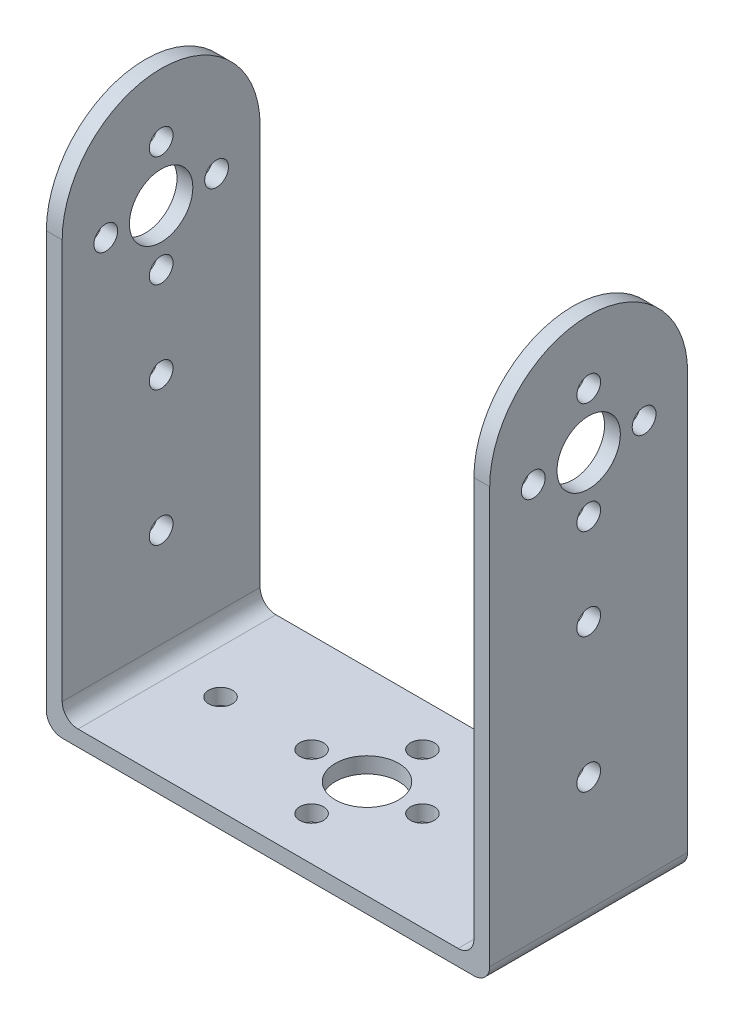
ISO-10303-21;
HEADER;
FILE_DESCRIPTION(('STEP AP214'),'2;1');
FILE_NAME('part.step','',(''),(''),'','','');
FILE_SCHEMA(('AUTOMOTIVE_DESIGN { 1 0 10303 214 1 1 1 1 }'));
ENDSEC;
DATA;
#1=APPLICATION_CONTEXT('core data for automotive mechanical design processes');
#2=APPLICATION_PROTOCOL_DEFINITION('international standard','automotive_design',2000,#1);
#3=PRODUCT_CONTEXT('',#1,'mechanical');
#4=PRODUCT('Part','Part','',(#3));
#5=PRODUCT_RELATED_PRODUCT_CATEGORY('part','',(#4));
#6=PRODUCT_DEFINITION_FORMATION('','',#4);
#7=PRODUCT_DEFINITION_CONTEXT('part definition',#1,'design');
#8=PRODUCT_DEFINITION('design','',#6,#7);
#9=PRODUCT_DEFINITION_SHAPE('','',#8);
#10=(LENGTH_UNIT() NAMED_UNIT(*) SI_UNIT(.MILLI.,.METRE.));
#11=(NAMED_UNIT(*) PLANE_ANGLE_UNIT() SI_UNIT($,.RADIAN.));
#12=(NAMED_UNIT(*) SI_UNIT($,.STERADIAN.) SOLID_ANGLE_UNIT());
#13=UNCERTAINTY_MEASURE_WITH_UNIT(LENGTH_MEASURE(1.E-05),#10,'distance_accuracy_value','');
#14=(GEOMETRIC_REPRESENTATION_CONTEXT(3) GLOBAL_UNCERTAINTY_ASSIGNED_CONTEXT((#13)) GLOBAL_UNIT_ASSIGNED_CONTEXT((#10,
#11,#12)) REPRESENTATION_CONTEXT('',''));
#15=CARTESIAN_POINT('',(0.,0.,0.));
#16=DIRECTION('',(0.,0.,1.));
#17=DIRECTION('',(1.,0.,0.));
#18=AXIS2_PLACEMENT_3D('',#15,#16,#17);
#19=CARTESIAN_POINT('',(28.,-2.,0.));
#20=DIRECTION('',(1.,0.,0.));
#21=DIRECTION('',(0.,0.,-1.));
#22=AXIS2_PLACEMENT_3D('',#19,#20,#21);
#23=PLANE('',#22);
#24=CARTESIAN_POINT('',(28.,50.,6.9999999999999));
#25=DIRECTION('',(1.,0.,0.));
#26=DIRECTION('',(0.,0.,-1.));
#27=AXIS2_PLACEMENT_3D('',#24,#25,#26);
#28=CIRCLE('',#27,1.5);
#29=CARTESIAN_POINT('',(28.,50.,5.4999999999999));
#30=VERTEX_POINT('',#29);
#31=EDGE_CURVE('E490',#30,#30,#28,.T.);
#32=ORIENTED_EDGE('',*,*,#31,.F.);
#33=EDGE_LOOP('',(#32));
#34=FACE_BOUND('',#33,.T.);
#35=CARTESIAN_POINT('',(28.,57.,0.));
#36=DIRECTION('',(1.,0.,0.));
#37=DIRECTION('',(0.,0.,-1.));
#38=AXIS2_PLACEMENT_3D('',#35,#36,#37);
#39=CIRCLE('',#38,1.5);
#40=CARTESIAN_POINT('',(28.,57.,-1.5));
#41=VERTEX_POINT('',#40);
#42=EDGE_CURVE('E487',#41,#41,#39,.T.);
#43=ORIENTED_EDGE('',*,*,#42,.F.);
#44=EDGE_LOOP('',(#43));
#45=FACE_BOUND('',#44,.T.);
#46=CARTESIAN_POINT('',(28.,50.0000000000001,-7.0000000000001));
#47=DIRECTION('',(1.,0.,0.));
#48=DIRECTION('',(0.,0.,-1.));
#49=AXIS2_PLACEMENT_3D('',#46,#47,#48);
#50=CIRCLE('',#49,1.5);
#51=CARTESIAN_POINT('',(28.,50.0000000000001,-8.50000000000009));
#52=VERTEX_POINT('',#51);
#53=EDGE_CURVE('E484',#52,#52,#50,.T.);
#54=ORIENTED_EDGE('',*,*,#53,.F.);
#55=EDGE_LOOP('',(#54));
#56=FACE_BOUND('',#55,.T.);
#57=CARTESIAN_POINT('',(28.,43.,-1.46642216231412E-13));
#58=DIRECTION('',(1.,0.,0.));
#59=DIRECTION('',(0.,0.,-1.));
#60=AXIS2_PLACEMENT_3D('',#57,#58,#59);
#61=CIRCLE('',#60,1.5);
#62=CARTESIAN_POINT('',(28.,43.,-1.50000000000015));
#63=VERTEX_POINT('',#62);
#64=EDGE_CURVE('E483',#63,#63,#61,.T.);
#65=ORIENTED_EDGE('',*,*,#64,.F.);
#66=EDGE_LOOP('',(#65));
#67=FACE_BOUND('',#66,.T.);
#68=CARTESIAN_POINT('',(28.,31.5,0.));
#69=DIRECTION('',(1.,0.,0.));
#70=DIRECTION('',(0.,0.,-1.));
#71=AXIS2_PLACEMENT_3D('',#68,#69,#70);
#72=CIRCLE('',#71,1.5);
#73=CARTESIAN_POINT('',(28.,31.5,-1.5));
#74=VERTEX_POINT('',#73);
#75=EDGE_CURVE('E196',#74,#74,#72,.T.);
#76=ORIENTED_EDGE('',*,*,#75,.F.);
#77=EDGE_LOOP('',(#76));
#78=FACE_BOUND('',#77,.T.);
#79=CARTESIAN_POINT('',(28.,14.5,0.));
#80=DIRECTION('',(1.,0.,0.));
#81=DIRECTION('',(0.,0.,-1.));
#82=AXIS2_PLACEMENT_3D('',#79,#80,#81);
#83=CIRCLE('',#82,1.5);
#84=CARTESIAN_POINT('',(28.,14.5,-1.5));
#85=VERTEX_POINT('',#84);
#86=EDGE_CURVE('E345',#85,#85,#83,.T.);
#87=ORIENTED_EDGE('',*,*,#86,.F.);
#88=EDGE_LOOP('',(#87));
#89=FACE_BOUND('',#88,.T.);
#90=CARTESIAN_POINT('',(28.,50.,0.));
#91=DIRECTION('',(1.,0.,0.));
#92=DIRECTION('',(0.,0.,-1.));
#93=AXIS2_PLACEMENT_3D('',#90,#91,#92);
#94=CIRCLE('',#93,4.);
#95=CARTESIAN_POINT('',(28.,50.,-4.));
#96=VERTEX_POINT('',#95);
#97=EDGE_CURVE('E341',#96,#96,#94,.T.);
#98=ORIENTED_EDGE('',*,*,#97,.F.);
#99=EDGE_LOOP('',(#98));
#100=FACE_BOUND('',#99,.T.);
#101=CARTESIAN_POINT('',(28.,52.5,0.));
#102=DIRECTION('',(1.,0.,0.));
#103=DIRECTION('',(0.,0.,-1.));
#104=AXIS2_PLACEMENT_3D('',#101,#102,#103);
#105=CIRCLE('',#104,12.5);
#106=CARTESIAN_POINT('',(28.,52.5,-12.5));
#107=VERTEX_POINT('',#106);
#108=CARTESIAN_POINT('',(28.,52.5,12.5));
#109=VERTEX_POINT('',#108);
#110=EDGE_CURVE('E178',#107,#109,#105,.T.);
#111=ORIENTED_EDGE('',*,*,#110,.T.);
#112=DIRECTION('',(0.,1.,0.));
#113=VECTOR('',#112,1.);
#114=CARTESIAN_POINT('',(28.,-2.,12.5));
#115=LINE('',#114,#113);
#116=CARTESIAN_POINT('',(28.,0.,12.5));
#117=VERTEX_POINT('',#116);
#118=EDGE_CURVE('E182',#117,#109,#115,.T.);
#119=ORIENTED_EDGE('',*,*,#118,.F.);
#120=DIRECTION('',(0.,0.,-1.));
#121=VECTOR('',#120,1.);
#122=CARTESIAN_POINT('',(28.,0.,-12.5));
#123=LINE('',#122,#121);
#124=CARTESIAN_POINT('',(28.,0.,-12.5));
#125=VERTEX_POINT('',#124);
#126=EDGE_CURVE('E205',#117,#125,#123,.T.);
#127=ORIENTED_EDGE('',*,*,#126,.T.);
#128=DIRECTION('',(0.,1.,0.));
#129=VECTOR('',#128,1.);
#130=CARTESIAN_POINT('',(28.,-2.,-12.5));
#131=LINE('',#130,#129);
#132=EDGE_CURVE('E185',#125,#107,#131,.T.);
#133=ORIENTED_EDGE('',*,*,#132,.T.);
#134=EDGE_LOOP('',(#111,#119,#127,#133));
#135=FACE_BOUND('',#134,.T.);
#136=ADVANCED_FACE('F84',(#34,#45,#56,#67,#78,#89,#100,#135),#23,.T.);
#137=CARTESIAN_POINT('',(-28.,-2.,0.));
#138=DIRECTION('',(1.,0.,0.));
#139=DIRECTION('',(0.,0.,-1.));
#140=AXIS2_PLACEMENT_3D('',#137,#138,#139);
#141=PLANE('',#140);
#142=CARTESIAN_POINT('',(-28.,50.,6.9999999999999));
#143=DIRECTION('',(1.,0.,0.));
#144=DIRECTION('',(0.,0.,-1.));
#145=AXIS2_PLACEMENT_3D('',#142,#143,#144);
#146=CIRCLE('',#145,1.5);
#147=CARTESIAN_POINT('',(-28.,50.,5.4999999999999));
#148=VERTEX_POINT('',#147);
#149=EDGE_CURVE('E189',#148,#148,#146,.T.);
#150=ORIENTED_EDGE('',*,*,#149,.T.);
#151=EDGE_LOOP('',(#150));
#152=FACE_BOUND('',#151,.T.);
#153=CARTESIAN_POINT('',(-28.,57.,0.));
#154=DIRECTION('',(1.,0.,0.));
#155=DIRECTION('',(0.,0.,-1.));
#156=AXIS2_PLACEMENT_3D('',#153,#154,#155);
#157=CIRCLE('',#156,1.5);
#158=CARTESIAN_POINT('',(-28.,57.,-1.5));
#159=VERTEX_POINT('',#158);
#160=EDGE_CURVE('E274',#159,#159,#157,.T.);
#161=ORIENTED_EDGE('',*,*,#160,.T.);
#162=EDGE_LOOP('',(#161));
#163=FACE_BOUND('',#162,.T.);
#164=CARTESIAN_POINT('',(-28.,50.0000000000001,-7.0000000000001));
#165=DIRECTION('',(1.,0.,0.));
#166=DIRECTION('',(0.,0.,-1.));
#167=AXIS2_PLACEMENT_3D('',#164,#165,#166);
#168=CIRCLE('',#167,1.5);
#169=CARTESIAN_POINT('',(-28.,50.0000000000001,-8.50000000000009));
#170=VERTEX_POINT('',#169);
#171=EDGE_CURVE('E270',#170,#170,#168,.T.);
#172=ORIENTED_EDGE('',*,*,#171,.T.);
#173=EDGE_LOOP('',(#172));
#174=FACE_BOUND('',#173,.T.);
#175=CARTESIAN_POINT('',(-28.,43.,-1.46642216231412E-13));
#176=DIRECTION('',(1.,0.,0.));
#177=DIRECTION('',(0.,0.,-1.));
#178=AXIS2_PLACEMENT_3D('',#175,#176,#177);
#179=CIRCLE('',#178,1.5);
#180=CARTESIAN_POINT('',(-28.,43.,-1.50000000000015));
#181=VERTEX_POINT('',#180);
#182=EDGE_CURVE('E266',#181,#181,#179,.T.);
#183=ORIENTED_EDGE('',*,*,#182,.T.);
#184=EDGE_LOOP('',(#183));
#185=FACE_BOUND('',#184,.T.);
#186=CARTESIAN_POINT('',(-28.,50.,0.));
#187=DIRECTION('',(1.,0.,0.));
#188=DIRECTION('',(0.,0.,-1.));
#189=AXIS2_PLACEMENT_3D('',#186,#187,#188);
#190=CIRCLE('',#189,4.);
#191=CARTESIAN_POINT('',(-28.,50.,-4.));
#192=VERTEX_POINT('',#191);
#193=EDGE_CURVE('E252',#192,#192,#190,.T.);
#194=ORIENTED_EDGE('',*,*,#193,.T.);
#195=EDGE_LOOP('',(#194));
#196=FACE_BOUND('',#195,.T.);
#197=CARTESIAN_POINT('',(-28.,14.5,0.));
#198=DIRECTION('',(1.,0.,0.));
#199=DIRECTION('',(0.,0.,-1.));
#200=AXIS2_PLACEMENT_3D('',#197,#198,#199);
#201=CIRCLE('',#200,1.5);
#202=CARTESIAN_POINT('',(-28.,14.5,-1.5));
#203=VERTEX_POINT('',#202);
#204=EDGE_CURVE('E257',#203,#203,#201,.T.);
#205=ORIENTED_EDGE('',*,*,#204,.T.);
#206=EDGE_LOOP('',(#205));
#207=FACE_BOUND('',#206,.T.);
#208=CARTESIAN_POINT('',(-28.,31.5,0.));
#209=DIRECTION('',(1.,0.,0.));
#210=DIRECTION('',(0.,0.,-1.));
#211=AXIS2_PLACEMENT_3D('',#208,#209,#210);
#212=CIRCLE('',#211,1.5);
#213=CARTESIAN_POINT('',(-28.,31.5,-1.5));
#214=VERTEX_POINT('',#213);
#215=EDGE_CURVE('E262',#214,#214,#212,.T.);
#216=ORIENTED_EDGE('',*,*,#215,.T.);
#217=EDGE_LOOP('',(#216));
#218=FACE_BOUND('',#217,.T.);
#219=DIRECTION('',(0.,1.,0.));
#220=VECTOR('',#219,1.);
#221=CARTESIAN_POINT('',(-28.,-2.,12.5));
#222=LINE('',#221,#220);
#223=CARTESIAN_POINT('',(-28.,0.,12.5));
#224=VERTEX_POINT('',#223);
#225=CARTESIAN_POINT('',(-28.,52.5,12.5));
#226=VERTEX_POINT('',#225);
#227=EDGE_CURVE('E203',#224,#226,#222,.T.);
#228=ORIENTED_EDGE('',*,*,#227,.T.);
#229=CARTESIAN_POINT('',(-28.,52.5,0.));
#230=DIRECTION('',(1.,0.,0.));
#231=DIRECTION('',(0.,0.,-1.));
#232=AXIS2_PLACEMENT_3D('',#229,#230,#231);
#233=CIRCLE('',#232,12.5);
#234=CARTESIAN_POINT('',(-28.,52.5,-12.5));
#235=VERTEX_POINT('',#234);
#236=EDGE_CURVE('E296',#235,#226,#233,.T.);
#237=ORIENTED_EDGE('',*,*,#236,.F.);
#238=DIRECTION('',(0.,1.,0.));
#239=VECTOR('',#238,1.);
#240=CARTESIAN_POINT('',(-28.,-2.,-12.5));
#241=LINE('',#240,#239);
#242=CARTESIAN_POINT('',(-28.,0.,-12.5));
#243=VERTEX_POINT('',#242);
#244=EDGE_CURVE('E207',#243,#235,#241,.T.);
#245=ORIENTED_EDGE('',*,*,#244,.F.);
#246=DIRECTION('',(0.,0.,-1.));
#247=VECTOR('',#246,1.);
#248=CARTESIAN_POINT('',(-28.,0.,0.));
#249=LINE('',#248,#247);
#250=EDGE_CURVE('E109',#243,#224,#249,.F.);
#251=ORIENTED_EDGE('',*,*,#250,.T.);
#252=EDGE_LOOP('',(#228,#237,#245,#251));
#253=FACE_BOUND('',#252,.T.);
#254=ADVANCED_FACE('F362',(#152,#163,#174,#185,#196,#207,#218,#253),#141,.F.);
#255=CARTESIAN_POINT('',(-26.,65.,0.));
#256=DIRECTION('',(-1.,0.,0.));
#257=DIRECTION('',(0.,0.,1.));
#258=AXIS2_PLACEMENT_3D('',#255,#256,#257);
#259=PLANE('',#258);
#260=CARTESIAN_POINT('',(-26.,50.,6.9999999999999));
#261=DIRECTION('',(-1.,0.,0.));
#262=DIRECTION('',(0.,0.,1.));
#263=AXIS2_PLACEMENT_3D('',#260,#261,#262);
#264=CIRCLE('',#263,1.5);
#265=CARTESIAN_POINT('',(-26.,50.,8.4999999999999));
#266=VERTEX_POINT('',#265);
#267=EDGE_CURVE('E286',#266,#266,#264,.T.);
#268=ORIENTED_EDGE('',*,*,#267,.T.);
#269=EDGE_LOOP('',(#268));
#270=FACE_BOUND('',#269,.T.);
#271=CARTESIAN_POINT('',(-26.,57.,0.));
#272=DIRECTION('',(-1.,0.,0.));
#273=DIRECTION('',(0.,0.,1.));
#274=AXIS2_PLACEMENT_3D('',#271,#272,#273);
#275=CIRCLE('',#274,1.5);
#276=CARTESIAN_POINT('',(-26.,57.,1.5));
#277=VERTEX_POINT('',#276);
#278=EDGE_CURVE('E269',#277,#277,#275,.T.);
#279=ORIENTED_EDGE('',*,*,#278,.T.);
#280=EDGE_LOOP('',(#279));
#281=FACE_BOUND('',#280,.T.);
#282=CARTESIAN_POINT('',(-26.,50.0000000000001,-7.0000000000001));
#283=DIRECTION('',(-1.,0.,0.));
#284=DIRECTION('',(0.,0.,1.));
#285=AXIS2_PLACEMENT_3D('',#282,#283,#284);
#286=CIRCLE('',#285,1.5);
#287=CARTESIAN_POINT('',(-26.,50.0000000000001,-5.5000000000001));
#288=VERTEX_POINT('',#287);
#289=EDGE_CURVE('E265',#288,#288,#286,.T.);
#290=ORIENTED_EDGE('',*,*,#289,.T.);
#291=EDGE_LOOP('',(#290));
#292=FACE_BOUND('',#291,.T.);
#293=CARTESIAN_POINT('',(-26.,43.,-1.46642216231412E-13));
#294=DIRECTION('',(-1.,0.,0.));
#295=DIRECTION('',(0.,0.,1.));
#296=AXIS2_PLACEMENT_3D('',#293,#294,#295);
#297=CIRCLE('',#296,1.5);
#298=CARTESIAN_POINT('',(-26.,43.,1.49999999999985));
#299=VERTEX_POINT('',#298);
#300=EDGE_CURVE('E261',#299,#299,#297,.T.);
#301=ORIENTED_EDGE('',*,*,#300,.T.);
#302=EDGE_LOOP('',(#301));
#303=FACE_BOUND('',#302,.T.);
#304=CARTESIAN_POINT('',(-26.,50.,0.));
#305=DIRECTION('',(-1.,0.,0.));
#306=DIRECTION('',(0.,0.,1.));
#307=AXIS2_PLACEMENT_3D('',#304,#305,#306);
#308=CIRCLE('',#307,4.);
#309=CARTESIAN_POINT('',(-26.,50.,4.));
#310=VERTEX_POINT('',#309);
#311=EDGE_CURVE('E247',#310,#310,#308,.T.);
#312=ORIENTED_EDGE('',*,*,#311,.T.);
#313=EDGE_LOOP('',(#312));
#314=FACE_BOUND('',#313,.T.);
#315=CARTESIAN_POINT('',(-26.,14.5,0.));
#316=DIRECTION('',(-1.,0.,0.));
#317=DIRECTION('',(0.,0.,1.));
#318=AXIS2_PLACEMENT_3D('',#315,#316,#317);
#319=CIRCLE('',#318,1.5);
#320=CARTESIAN_POINT('',(-26.,14.5,1.5));
#321=VERTEX_POINT('',#320);
#322=EDGE_CURVE('E251',#321,#321,#319,.T.);
#323=ORIENTED_EDGE('',*,*,#322,.T.);
#324=EDGE_LOOP('',(#323));
#325=FACE_BOUND('',#324,.T.);
#326=CARTESIAN_POINT('',(-26.,31.5,0.));
#327=DIRECTION('',(-1.,0.,0.));
#328=DIRECTION('',(0.,0.,1.));
#329=AXIS2_PLACEMENT_3D('',#326,#327,#328);
#330=CIRCLE('',#329,1.5);
#331=CARTESIAN_POINT('',(-26.,31.5,1.5));
#332=VERTEX_POINT('',#331);
#333=EDGE_CURVE('E256',#332,#332,#330,.T.);
#334=ORIENTED_EDGE('',*,*,#333,.T.);
#335=EDGE_LOOP('',(#334));
#336=FACE_BOUND('',#335,.T.);
#337=CARTESIAN_POINT('',(-26.,52.5,0.));
#338=DIRECTION('',(-1.,0.,0.));
#339=DIRECTION('',(0.,0.,1.));
#340=AXIS2_PLACEMENT_3D('',#337,#338,#339);
#341=CIRCLE('',#340,12.5);
#342=CARTESIAN_POINT('',(-26.,52.5,12.5));
#343=VERTEX_POINT('',#342);
#344=CARTESIAN_POINT('',(-26.,52.5,-12.5));
#345=VERTEX_POINT('',#344);
#346=EDGE_CURVE('E294',#343,#345,#341,.T.);
#347=ORIENTED_EDGE('',*,*,#346,.F.);
#348=DIRECTION('',(0.,-1.,0.));
#349=VECTOR('',#348,1.);
#350=CARTESIAN_POINT('',(-26.,65.,12.5));
#351=LINE('',#350,#349);
#352=CARTESIAN_POINT('',(-26.,2.,12.5));
#353=VERTEX_POINT('',#352);
#354=EDGE_CURVE('E303',#343,#353,#351,.T.);
#355=ORIENTED_EDGE('',*,*,#354,.T.);
#356=DIRECTION('',(0.,0.,-1.));
#357=VECTOR('',#356,1.);
#358=CARTESIAN_POINT('',(-26.,2.,0.));
#359=LINE('',#358,#357);
#360=CARTESIAN_POINT('',(-26.,2.,-12.5));
#361=VERTEX_POINT('',#360);
#362=EDGE_CURVE('E235',#353,#361,#359,.T.);
#363=ORIENTED_EDGE('',*,*,#362,.T.);
#364=DIRECTION('',(0.,-1.,0.));
#365=VECTOR('',#364,1.);
#366=CARTESIAN_POINT('',(-26.,65.,-12.5));
#367=LINE('',#366,#365);
#368=EDGE_CURVE('E301',#345,#361,#367,.T.);
#369=ORIENTED_EDGE('',*,*,#368,.F.);
#370=EDGE_LOOP('',(#347,#355,#363,#369));
#371=FACE_BOUND('',#370,.T.);
#372=ADVANCED_FACE('F333',(#270,#281,#292,#303,#314,#325,#336,#371),#259,.F.);
#373=CARTESIAN_POINT('',(26.,65.,0.));
#374=DIRECTION('',(-1.,0.,0.));
#375=DIRECTION('',(0.,0.,1.));
#376=AXIS2_PLACEMENT_3D('',#373,#374,#375);
#377=PLANE('',#376);
#378=CARTESIAN_POINT('',(26.,50.,6.9999999999999));
#379=DIRECTION('',(-1.,0.,0.));
#380=DIRECTION('',(0.,0.,1.));
#381=AXIS2_PLACEMENT_3D('',#378,#379,#380);
#382=CIRCLE('',#381,1.5);
#383=CARTESIAN_POINT('',(26.,50.,8.4999999999999));
#384=VERTEX_POINT('',#383);
#385=EDGE_CURVE('E88',#384,#384,#382,.T.);
#386=ORIENTED_EDGE('',*,*,#385,.F.);
#387=EDGE_LOOP('',(#386));
#388=FACE_BOUND('',#387,.T.);
#389=CARTESIAN_POINT('',(26.,57.,0.));
#390=DIRECTION('',(-1.,0.,0.));
#391=DIRECTION('',(0.,0.,1.));
#392=AXIS2_PLACEMENT_3D('',#389,#390,#391);
#393=CIRCLE('',#392,1.5);
#394=CARTESIAN_POINT('',(26.,57.,1.5));
#395=VERTEX_POINT('',#394);
#396=EDGE_CURVE('E267',#395,#395,#393,.T.);
#397=ORIENTED_EDGE('',*,*,#396,.F.);
#398=EDGE_LOOP('',(#397));
#399=FACE_BOUND('',#398,.T.);
#400=CARTESIAN_POINT('',(26.,50.0000000000001,-7.0000000000001));
#401=DIRECTION('',(-1.,0.,0.));
#402=DIRECTION('',(0.,0.,1.));
#403=AXIS2_PLACEMENT_3D('',#400,#401,#402);
#404=CIRCLE('',#403,1.5);
#405=CARTESIAN_POINT('',(26.,50.0000000000001,-5.5000000000001));
#406=VERTEX_POINT('',#405);
#407=EDGE_CURVE('E263',#406,#406,#404,.T.);
#408=ORIENTED_EDGE('',*,*,#407,.F.);
#409=EDGE_LOOP('',(#408));
#410=FACE_BOUND('',#409,.T.);
#411=CARTESIAN_POINT('',(26.,43.,-1.46642216231412E-13));
#412=DIRECTION('',(-1.,0.,0.));
#413=DIRECTION('',(0.,0.,1.));
#414=AXIS2_PLACEMENT_3D('',#411,#412,#413);
#415=CIRCLE('',#414,1.5);
#416=CARTESIAN_POINT('',(26.,43.,1.49999999999985));
#417=VERTEX_POINT('',#416);
#418=EDGE_CURVE('E258',#417,#417,#415,.T.);
#419=ORIENTED_EDGE('',*,*,#418,.F.);
#420=EDGE_LOOP('',(#419));
#421=FACE_BOUND('',#420,.T.);
#422=CARTESIAN_POINT('',(26.,31.5,0.));
#423=DIRECTION('',(-1.,0.,0.));
#424=DIRECTION('',(0.,0.,1.));
#425=AXIS2_PLACEMENT_3D('',#422,#423,#424);
#426=CIRCLE('',#425,1.5);
#427=CARTESIAN_POINT('',(26.,31.5,1.5));
#428=VERTEX_POINT('',#427);
#429=EDGE_CURVE('E253',#428,#428,#426,.T.);
#430=ORIENTED_EDGE('',*,*,#429,.F.);
#431=EDGE_LOOP('',(#430));
#432=FACE_BOUND('',#431,.T.);
#433=CARTESIAN_POINT('',(26.,14.5,0.));
#434=DIRECTION('',(-1.,0.,0.));
#435=DIRECTION('',(0.,0.,1.));
#436=AXIS2_PLACEMENT_3D('',#433,#434,#435);
#437=CIRCLE('',#436,1.5);
#438=CARTESIAN_POINT('',(26.,14.5,1.5));
#439=VERTEX_POINT('',#438);
#440=EDGE_CURVE('E248',#439,#439,#437,.T.);
#441=ORIENTED_EDGE('',*,*,#440,.F.);
#442=EDGE_LOOP('',(#441));
#443=FACE_BOUND('',#442,.T.);
#444=CARTESIAN_POINT('',(26.,50.,0.));
#445=DIRECTION('',(-1.,0.,0.));
#446=DIRECTION('',(0.,0.,1.));
#447=AXIS2_PLACEMENT_3D('',#444,#445,#446);
#448=CIRCLE('',#447,4.);
#449=CARTESIAN_POINT('',(26.,50.,4.));
#450=VERTEX_POINT('',#449);
#451=EDGE_CURVE('E244',#450,#450,#448,.T.);
#452=ORIENTED_EDGE('',*,*,#451,.F.);
#453=EDGE_LOOP('',(#452));
#454=FACE_BOUND('',#453,.T.);
#455=DIRECTION('',(0.,-1.,0.));
#456=VECTOR('',#455,1.);
#457=CARTESIAN_POINT('',(26.,65.,12.5));
#458=LINE('',#457,#456);
#459=CARTESIAN_POINT('',(26.,52.5,12.5));
#460=VERTEX_POINT('',#459);
#461=CARTESIAN_POINT('',(26.,2.,12.5));
#462=VERTEX_POINT('',#461);
#463=EDGE_CURVE('E101',#460,#462,#458,.T.);
#464=ORIENTED_EDGE('',*,*,#463,.F.);
#465=CARTESIAN_POINT('',(26.,52.5,0.));
#466=DIRECTION('',(-1.,0.,0.));
#467=DIRECTION('',(0.,0.,1.));
#468=AXIS2_PLACEMENT_3D('',#465,#466,#467);
#469=CIRCLE('',#468,12.5);
#470=CARTESIAN_POINT('',(26.,52.5,-12.5));
#471=VERTEX_POINT('',#470);
#472=EDGE_CURVE('E194',#460,#471,#469,.T.);
#473=ORIENTED_EDGE('',*,*,#472,.T.);
#474=DIRECTION('',(0.,-1.,0.));
#475=VECTOR('',#474,1.);
#476=CARTESIAN_POINT('',(26.,65.,-12.5));
#477=LINE('',#476,#475);
#478=CARTESIAN_POINT('',(26.,2.,-12.5));
#479=VERTEX_POINT('',#478);
#480=EDGE_CURVE('E299',#471,#479,#477,.T.);
#481=ORIENTED_EDGE('',*,*,#480,.T.);
#482=DIRECTION('',(0.,0.,-1.));
#483=VECTOR('',#482,1.);
#484=CARTESIAN_POINT('',(26.,2.,12.5));
#485=LINE('',#484,#483);
#486=EDGE_CURVE('E232',#479,#462,#485,.F.);
#487=ORIENTED_EDGE('',*,*,#486,.T.);
#488=EDGE_LOOP('',(#464,#473,#481,#487));
#489=FACE_BOUND('',#488,.T.);
#490=ADVANCED_FACE('F406',(#388,#399,#410,#421,#432,#443,#454,#489),#377,.T.);
#491=CARTESIAN_POINT('',(0.,-2.,-12.5));
#492=DIRECTION('',(0.,0.,1.));
#493=DIRECTION('',(1.,0.,0.));
#494=AXIS2_PLACEMENT_3D('',#491,#492,#493);
#495=PLANE('',#494);
#496=ORIENTED_EDGE('',*,*,#244,.T.);
#497=DIRECTION('',(1.,0.,0.));
#498=VECTOR('',#497,1.);
#499=CARTESIAN_POINT('',(-37.,52.5,-12.5));
#500=LINE('',#499,#498);
#501=EDGE_CURVE('E292',#235,#345,#500,.T.);
#502=ORIENTED_EDGE('',*,*,#501,.T.);
#503=ORIENTED_EDGE('',*,*,#368,.T.);
#504=CARTESIAN_POINT('',(-24.,2.,-12.5));
#505=DIRECTION('',(0.,0.,1.));
#506=DIRECTION('',(1.,0.,0.));
#507=AXIS2_PLACEMENT_3D('',#504,#505,#506);
#508=CIRCLE('',#507,2.);
#509=CARTESIAN_POINT('',(-24.,0.,-12.5));
#510=VERTEX_POINT('',#509);
#511=EDGE_CURVE('E93',#361,#510,#508,.T.);
#512=ORIENTED_EDGE('',*,*,#511,.T.);
#513=DIRECTION('',(1.,0.,0.));
#514=VECTOR('',#513,1.);
#515=CARTESIAN_POINT('',(0.,0.,-12.5));
#516=LINE('',#515,#514);
#517=CARTESIAN_POINT('',(24.,0.,-12.5));
#518=VERTEX_POINT('',#517);
#519=EDGE_CURVE('E305',#510,#518,#516,.T.);
#520=ORIENTED_EDGE('',*,*,#519,.T.);
#521=CARTESIAN_POINT('',(24.,2.,-12.5));
#522=DIRECTION('',(0.,0.,1.));
#523=DIRECTION('',(1.,0.,0.));
#524=AXIS2_PLACEMENT_3D('',#521,#522,#523);
#525=CIRCLE('',#524,2.);
#526=EDGE_CURVE('E238',#518,#479,#525,.T.);
#527=ORIENTED_EDGE('',*,*,#526,.T.);
#528=ORIENTED_EDGE('',*,*,#480,.F.);
#529=EDGE_CURVE('E188',#471,#107,#500,.T.);
#530=ORIENTED_EDGE('',*,*,#529,.T.);
#531=ORIENTED_EDGE('',*,*,#132,.F.);
#532=CARTESIAN_POINT('',(26.,0.,-12.5));
#533=DIRECTION('',(0.,0.,1.));
#534=DIRECTION('',(1.,0.,0.));
#535=AXIS2_PLACEMENT_3D('',#532,#533,#534);
#536=CIRCLE('',#535,2.);
#537=CARTESIAN_POINT('',(26.,-2.,-12.5));
#538=VERTEX_POINT('',#537);
#539=EDGE_CURVE('E217',#125,#538,#536,.F.);
#540=ORIENTED_EDGE('',*,*,#539,.T.);
#541=DIRECTION('',(1.,0.,0.));
#542=VECTOR('',#541,1.);
#543=CARTESIAN_POINT('',(0.,-2.,-12.5));
#544=LINE('',#543,#542);
#545=CARTESIAN_POINT('',(-26.,-2.,-12.5));
#546=VERTEX_POINT('',#545);
#547=EDGE_CURVE('E306',#546,#538,#544,.T.);
#548=ORIENTED_EDGE('',*,*,#547,.F.);
#549=CARTESIAN_POINT('',(-26.,0.,-12.5));
#550=DIRECTION('',(0.,0.,1.));
#551=DIRECTION('',(1.,0.,0.));
#552=AXIS2_PLACEMENT_3D('',#549,#550,#551);
#553=CIRCLE('',#552,2.);
#554=EDGE_CURVE('E215',#546,#243,#553,.F.);
#555=ORIENTED_EDGE('',*,*,#554,.T.);
#556=EDGE_LOOP('',(#496,#502,#503,#512,#520,#527,#528,#530,#531,#540,#548,#555));
#557=FACE_BOUND('',#556,.T.);
#558=ADVANCED_FACE('F326',(#557),#495,.F.);
#559=CARTESIAN_POINT('',(0.,-2.,12.5));
#560=DIRECTION('',(0.,0.,1.));
#561=DIRECTION('',(1.,0.,0.));
#562=AXIS2_PLACEMENT_3D('',#559,#560,#561);
#563=PLANE('',#562);
#564=DIRECTION('',(1.,0.,0.));
#565=VECTOR('',#564,1.);
#566=CARTESIAN_POINT('',(-37.,52.5,12.5));
#567=LINE('',#566,#565);
#568=EDGE_CURVE('E195',#226,#343,#567,.T.);
#569=ORIENTED_EDGE('',*,*,#568,.F.);
#570=ORIENTED_EDGE('',*,*,#227,.F.);
#571=CARTESIAN_POINT('',(-26.,0.,12.5));
#572=DIRECTION('',(0.,0.,1.));
#573=DIRECTION('',(1.,0.,0.));
#574=AXIS2_PLACEMENT_3D('',#571,#572,#573);
#575=CIRCLE('',#574,2.);
#576=CARTESIAN_POINT('',(-26.,-2.,12.5));
#577=VERTEX_POINT('',#576);
#578=EDGE_CURVE('E224',#224,#577,#575,.T.);
#579=ORIENTED_EDGE('',*,*,#578,.T.);
#580=DIRECTION('',(1.,0.,0.));
#581=VECTOR('',#580,1.);
#582=CARTESIAN_POINT('',(0.,-2.,12.5));
#583=LINE('',#582,#581);
#584=CARTESIAN_POINT('',(26.,-2.,12.5));
#585=VERTEX_POINT('',#584);
#586=EDGE_CURVE('E213',#577,#585,#583,.T.);
#587=ORIENTED_EDGE('',*,*,#586,.T.);
#588=CARTESIAN_POINT('',(26.,0.,12.5));
#589=DIRECTION('',(0.,0.,1.));
#590=DIRECTION('',(1.,0.,0.));
#591=AXIS2_PLACEMENT_3D('',#588,#589,#590);
#592=CIRCLE('',#591,2.);
#593=EDGE_CURVE('E202',#585,#117,#592,.T.);
#594=ORIENTED_EDGE('',*,*,#593,.T.);
#595=ORIENTED_EDGE('',*,*,#118,.T.);
#596=EDGE_CURVE('E191',#460,#109,#567,.T.);
#597=ORIENTED_EDGE('',*,*,#596,.F.);
#598=ORIENTED_EDGE('',*,*,#463,.T.);
#599=CARTESIAN_POINT('',(24.,2.,12.5));
#600=DIRECTION('',(0.,0.,1.));
#601=DIRECTION('',(1.,0.,0.));
#602=AXIS2_PLACEMENT_3D('',#599,#600,#601);
#603=CIRCLE('',#602,2.);
#604=CARTESIAN_POINT('',(24.,0.,12.5));
#605=VERTEX_POINT('',#604);
#606=EDGE_CURVE('E241',#462,#605,#603,.F.);
#607=ORIENTED_EDGE('',*,*,#606,.T.);
#608=DIRECTION('',(1.,0.,0.));
#609=VECTOR('',#608,1.);
#610=CARTESIAN_POINT('',(0.,0.,12.5));
#611=LINE('',#610,#609);
#612=CARTESIAN_POINT('',(-24.,0.,12.5));
#613=VERTEX_POINT('',#612);
#614=EDGE_CURVE('E309',#613,#605,#611,.T.);
#615=ORIENTED_EDGE('',*,*,#614,.F.);
#616=CARTESIAN_POINT('',(-24.,2.,12.5));
#617=DIRECTION('',(0.,0.,1.));
#618=DIRECTION('',(1.,0.,0.));
#619=AXIS2_PLACEMENT_3D('',#616,#617,#618);
#620=CIRCLE('',#619,2.);
#621=EDGE_CURVE('E12',#613,#353,#620,.F.);
#622=ORIENTED_EDGE('',*,*,#621,.T.);
#623=ORIENTED_EDGE('',*,*,#354,.F.);
#624=EDGE_LOOP('',(#569,#570,#579,#587,#594,#595,#597,#598,#607,#615,#622,#623));
#625=FACE_BOUND('',#624,.T.);
#626=ADVANCED_FACE('F199',(#625),#563,.T.);
#627=CARTESIAN_POINT('',(0.,-2.,0.));
#628=DIRECTION('',(0.,1.,0.));
#629=DIRECTION('',(0.,0.,1.));
#630=AXIS2_PLACEMENT_3D('',#627,#628,#629);
#631=PLANE('',#630);
#632=CARTESIAN_POINT('',(0.,-2.,-7.));
#633=DIRECTION('',(0.,1.,0.));
#634=DIRECTION('',(0.,0.,1.));
#635=AXIS2_PLACEMENT_3D('',#632,#633,#634);
#636=CIRCLE('',#635,1.5);
#637=CARTESIAN_POINT('',(0.,-2.,-5.5));
#638=VERTEX_POINT('',#637);
#639=EDGE_CURVE('E445',#638,#638,#636,.T.);
#640=ORIENTED_EDGE('',*,*,#639,.T.);
#641=EDGE_LOOP('',(#640));
#642=FACE_BOUND('',#641,.T.);
#643=CARTESIAN_POINT('',(-18.5,-2.,0.));
#644=DIRECTION('',(0.,1.,0.));
#645=DIRECTION('',(0.,0.,1.));
#646=AXIS2_PLACEMENT_3D('',#643,#644,#645);
#647=CIRCLE('',#646,1.5);
#648=CARTESIAN_POINT('',(-18.5,-2.,1.5));
#649=VERTEX_POINT('',#648);
#650=EDGE_CURVE('E449',#649,#649,#647,.T.);
#651=ORIENTED_EDGE('',*,*,#650,.T.);
#652=EDGE_LOOP('',(#651));
#653=FACE_BOUND('',#652,.T.);
#654=CARTESIAN_POINT('',(18.5,-2.,0.));
#655=DIRECTION('',(0.,1.,0.));
#656=DIRECTION('',(0.,0.,1.));
#657=AXIS2_PLACEMENT_3D('',#654,#655,#656);
#658=CIRCLE('',#657,1.5);
#659=CARTESIAN_POINT('',(18.5,-2.,1.5));
#660=VERTEX_POINT('',#659);
#661=EDGE_CURVE('E453',#660,#660,#658,.T.);
#662=ORIENTED_EDGE('',*,*,#661,.T.);
#663=EDGE_LOOP('',(#662));
#664=FACE_BOUND('',#663,.T.);
#665=CARTESIAN_POINT('',(7.0000000000002,-2.,-1.97666086873723E-13));
#666=DIRECTION('',(0.,1.,0.));
#667=DIRECTION('',(0.,0.,1.));
#668=AXIS2_PLACEMENT_3D('',#665,#666,#667);
#669=CIRCLE('',#668,1.50000000000015);
#670=CARTESIAN_POINT('',(7.0000000000002,-2.,1.49999999999996));
#671=VERTEX_POINT('',#670);
#672=EDGE_CURVE('E457',#671,#671,#669,.T.);
#673=ORIENTED_EDGE('',*,*,#672,.T.);
#674=EDGE_LOOP('',(#673));
#675=FACE_BOUND('',#674,.T.);
#676=CARTESIAN_POINT('',(2.00586374889466E-13,-2.,6.9999999999998));
#677=DIRECTION('',(0.,1.,0.));
#678=DIRECTION('',(0.,0.,1.));
#679=AXIS2_PLACEMENT_3D('',#676,#677,#678);
#680=CIRCLE('',#679,1.5000000000003);
#681=CARTESIAN_POINT('',(2.00586374889466E-13,-2.,8.5000000000001));
#682=VERTEX_POINT('',#681);
#683=EDGE_CURVE('E461',#682,#682,#680,.T.);
#684=ORIENTED_EDGE('',*,*,#683,.T.);
#685=EDGE_LOOP('',(#684));
#686=FACE_BOUND('',#685,.T.);
#687=CARTESIAN_POINT('',(-6.9999999999998,-2.,1.98523339633126E-13));
#688=DIRECTION('',(0.,1.,0.));
#689=DIRECTION('',(0.,0.,1.));
#690=AXIS2_PLACEMENT_3D('',#687,#688,#689);
#691=CIRCLE('',#690,1.50000000000032);
#692=CARTESIAN_POINT('',(-6.9999999999998,-2.,1.50000000000052));
#693=VERTEX_POINT('',#692);
#694=EDGE_CURVE('E465',#693,#693,#691,.T.);
#695=ORIENTED_EDGE('',*,*,#694,.T.);
#696=EDGE_LOOP('',(#695));
#697=FACE_BOUND('',#696,.T.);
#698=CARTESIAN_POINT('',(0.,-2.,0.));
#699=DIRECTION('',(0.,1.,0.));
#700=DIRECTION('',(0.,0.,1.));
#701=AXIS2_PLACEMENT_3D('',#698,#699,#700);
#702=CIRCLE('',#701,4.);
#703=CARTESIAN_POINT('',(0.,-2.,4.));
#704=VERTEX_POINT('',#703);
#705=EDGE_CURVE('E468',#704,#704,#702,.T.);
#706=ORIENTED_EDGE('',*,*,#705,.T.);
#707=EDGE_LOOP('',(#706));
#708=FACE_BOUND('',#707,.T.);
#709=ORIENTED_EDGE('',*,*,#547,.T.);
#710=DIRECTION('',(0.,0.,-1.));
#711=VECTOR('',#710,1.);
#712=CARTESIAN_POINT('',(26.,-2.,12.5));
#713=LINE('',#712,#711);
#714=EDGE_CURVE('E222',#538,#585,#713,.F.);
#715=ORIENTED_EDGE('',*,*,#714,.T.);
#716=ORIENTED_EDGE('',*,*,#586,.F.);
#717=DIRECTION('',(0.,0.,-1.));
#718=VECTOR('',#717,1.);
#719=CARTESIAN_POINT('',(-26.,-2.,0.));
#720=LINE('',#719,#718);
#721=EDGE_CURVE('E219',#577,#546,#720,.T.);
#722=ORIENTED_EDGE('',*,*,#721,.T.);
#723=EDGE_LOOP('',(#709,#715,#716,#722));
#724=FACE_BOUND('',#723,.T.);
#725=ADVANCED_FACE('F402',(#642,#653,#664,#675,#686,#697,#708,#724),#631,.F.);
#726=CARTESIAN_POINT('',(0.,0.,0.));
#727=DIRECTION('',(0.,1.,0.));
#728=DIRECTION('',(0.,0.,1.));
#729=AXIS2_PLACEMENT_3D('',#726,#727,#728);
#730=PLANE('',#729);
#731=CARTESIAN_POINT('',(0.,0.,-7.));
#732=DIRECTION('',(0.,1.,0.));
#733=DIRECTION('',(0.,0.,1.));
#734=AXIS2_PLACEMENT_3D('',#731,#732,#733);
#735=CIRCLE('',#734,1.5);
#736=CARTESIAN_POINT('',(0.,0.,-5.5));
#737=VERTEX_POINT('',#736);
#738=EDGE_CURVE('E474',#737,#737,#735,.T.);
#739=ORIENTED_EDGE('',*,*,#738,.F.);
#740=EDGE_LOOP('',(#739));
#741=FACE_BOUND('',#740,.T.);
#742=CARTESIAN_POINT('',(-18.5,0.,0.));
#743=DIRECTION('',(0.,1.,0.));
#744=DIRECTION('',(0.,0.,1.));
#745=AXIS2_PLACEMENT_3D('',#742,#743,#744);
#746=CIRCLE('',#745,1.5);
#747=CARTESIAN_POINT('',(-18.5,0.,1.5));
#748=VERTEX_POINT('',#747);
#749=EDGE_CURVE('E790',#748,#748,#746,.T.);
#750=ORIENTED_EDGE('',*,*,#749,.F.);
#751=EDGE_LOOP('',(#750));
#752=FACE_BOUND('',#751,.T.);
#753=CARTESIAN_POINT('',(18.5,0.,0.));
#754=DIRECTION('',(0.,1.,0.));
#755=DIRECTION('',(0.,0.,1.));
#756=AXIS2_PLACEMENT_3D('',#753,#754,#755);
#757=CIRCLE('',#756,1.5);
#758=CARTESIAN_POINT('',(18.5,0.,1.5));
#759=VERTEX_POINT('',#758);
#760=EDGE_CURVE('E793',#759,#759,#757,.T.);
#761=ORIENTED_EDGE('',*,*,#760,.F.);
#762=EDGE_LOOP('',(#761));
#763=FACE_BOUND('',#762,.T.);
#764=CARTESIAN_POINT('',(7.0000000000002,0.,-1.97666086873723E-13));
#765=DIRECTION('',(0.,1.,0.));
#766=DIRECTION('',(0.,0.,1.));
#767=AXIS2_PLACEMENT_3D('',#764,#765,#766);
#768=CIRCLE('',#767,1.50000000000015);
#769=CARTESIAN_POINT('',(7.0000000000002,0.,1.49999999999996));
#770=VERTEX_POINT('',#769);
#771=EDGE_CURVE('E800',#770,#770,#768,.T.);
#772=ORIENTED_EDGE('',*,*,#771,.F.);
#773=EDGE_LOOP('',(#772));
#774=FACE_BOUND('',#773,.T.);
#775=CARTESIAN_POINT('',(2.00586374889466E-13,0.,6.9999999999998));
#776=DIRECTION('',(0.,1.,0.));
#777=DIRECTION('',(0.,0.,1.));
#778=AXIS2_PLACEMENT_3D('',#775,#776,#777);
#779=CIRCLE('',#778,1.5000000000003);
#780=CARTESIAN_POINT('',(2.00586374889466E-13,0.,8.5000000000001));
#781=VERTEX_POINT('',#780);
#782=EDGE_CURVE('E802',#781,#781,#779,.T.);
#783=ORIENTED_EDGE('',*,*,#782,.F.);
#784=EDGE_LOOP('',(#783));
#785=FACE_BOUND('',#784,.T.);
#786=CARTESIAN_POINT('',(-6.9999999999998,0.,1.98523339633126E-13));
#787=DIRECTION('',(0.,1.,0.));
#788=DIRECTION('',(0.,0.,1.));
#789=AXIS2_PLACEMENT_3D('',#786,#787,#788);
#790=CIRCLE('',#789,1.50000000000032);
#791=CARTESIAN_POINT('',(-6.9999999999998,0.,1.50000000000052));
#792=VERTEX_POINT('',#791);
#793=EDGE_CURVE('E796',#792,#792,#790,.T.);
#794=ORIENTED_EDGE('',*,*,#793,.F.);
#795=EDGE_LOOP('',(#794));
#796=FACE_BOUND('',#795,.T.);
#797=CARTESIAN_POINT('',(0.,0.,0.));
#798=DIRECTION('',(0.,1.,0.));
#799=DIRECTION('',(0.,0.,1.));
#800=AXIS2_PLACEMENT_3D('',#797,#798,#799);
#801=CIRCLE('',#800,4.);
#802=CARTESIAN_POINT('',(0.,0.,4.));
#803=VERTEX_POINT('',#802);
#804=EDGE_CURVE('E470',#803,#803,#801,.T.);
#805=ORIENTED_EDGE('',*,*,#804,.F.);
#806=EDGE_LOOP('',(#805));
#807=FACE_BOUND('',#806,.T.);
#808=ORIENTED_EDGE('',*,*,#614,.T.);
#809=DIRECTION('',(0.,0.,-1.));
#810=VECTOR('',#809,1.);
#811=CARTESIAN_POINT('',(24.,0.,-12.5));
#812=LINE('',#811,#810);
#813=EDGE_CURVE('E229',#605,#518,#812,.T.);
#814=ORIENTED_EDGE('',*,*,#813,.T.);
#815=ORIENTED_EDGE('',*,*,#519,.F.);
#816=DIRECTION('',(0.,0.,-1.));
#817=VECTOR('',#816,1.);
#818=CARTESIAN_POINT('',(-24.,0.,0.));
#819=LINE('',#818,#817);
#820=EDGE_CURVE('E227',#510,#613,#819,.F.);
#821=ORIENTED_EDGE('',*,*,#820,.T.);
#822=EDGE_LOOP('',(#808,#814,#815,#821));
#823=FACE_BOUND('',#822,.T.);
#824=ADVANCED_FACE('F316',(#741,#752,#763,#774,#785,#796,#807,#823),#730,.T.);
#825=CARTESIAN_POINT('',(26.,0.,0.));
#826=DIRECTION('',(0.,0.,1.));
#827=DIRECTION('',(1.,0.,0.));
#828=AXIS2_PLACEMENT_3D('',#825,#826,#827);
#829=CYLINDRICAL_SURFACE('',#828,2.);
#830=ORIENTED_EDGE('',*,*,#593,.F.);
#831=ORIENTED_EDGE('',*,*,#714,.F.);
#832=ORIENTED_EDGE('',*,*,#539,.F.);
#833=ORIENTED_EDGE('',*,*,#126,.F.);
#834=EDGE_LOOP('',(#830,#831,#832,#833));
#835=FACE_BOUND('',#834,.T.);
#836=ADVANCED_FACE('F407',(#835),#829,.T.);
#837=CARTESIAN_POINT('',(24.,2.,0.));
#838=DIRECTION('',(0.,0.,1.));
#839=DIRECTION('',(1.,0.,0.));
#840=AXIS2_PLACEMENT_3D('',#837,#838,#839);
#841=CYLINDRICAL_SURFACE('',#840,2.);
#842=ORIENTED_EDGE('',*,*,#606,.F.);
#843=ORIENTED_EDGE('',*,*,#486,.F.);
#844=ORIENTED_EDGE('',*,*,#526,.F.);
#845=ORIENTED_EDGE('',*,*,#813,.F.);
#846=EDGE_LOOP('',(#842,#843,#844,#845));
#847=FACE_BOUND('',#846,.T.);
#848=ADVANCED_FACE('F322',(#847),#841,.F.);
#849=CARTESIAN_POINT('',(-26.,0.,0.));
#850=DIRECTION('',(0.,0.,-1.));
#851=DIRECTION('',(-1.,0.,0.));
#852=AXIS2_PLACEMENT_3D('',#849,#850,#851);
#853=CYLINDRICAL_SURFACE('',#852,2.);
#854=ORIENTED_EDGE('',*,*,#578,.F.);
#855=ORIENTED_EDGE('',*,*,#250,.F.);
#856=ORIENTED_EDGE('',*,*,#554,.F.);
#857=ORIENTED_EDGE('',*,*,#721,.F.);
#858=EDGE_LOOP('',(#854,#855,#856,#857));
#859=FACE_BOUND('',#858,.T.);
#860=ADVANCED_FACE('F412',(#859),#853,.T.);
#861=CARTESIAN_POINT('',(-24.,2.,0.));
#862=DIRECTION('',(0.,0.,-1.));
#863=DIRECTION('',(-1.,0.,0.));
#864=AXIS2_PLACEMENT_3D('',#861,#862,#863);
#865=CYLINDRICAL_SURFACE('',#864,2.);
#866=ORIENTED_EDGE('',*,*,#621,.F.);
#867=ORIENTED_EDGE('',*,*,#820,.F.);
#868=ORIENTED_EDGE('',*,*,#511,.F.);
#869=ORIENTED_EDGE('',*,*,#362,.F.);
#870=EDGE_LOOP('',(#866,#867,#868,#869));
#871=FACE_BOUND('',#870,.T.);
#872=ADVANCED_FACE('F86',(#871),#865,.F.);
#873=CARTESIAN_POINT('',(-37.,52.5,0.));
#874=DIRECTION('',(1.,0.,0.));
#875=DIRECTION('',(0.,0.,-1.));
#876=AXIS2_PLACEMENT_3D('',#873,#874,#875);
#877=CYLINDRICAL_SURFACE('',#876,12.5);
#878=ORIENTED_EDGE('',*,*,#472,.F.);
#879=ORIENTED_EDGE('',*,*,#596,.T.);
#880=ORIENTED_EDGE('',*,*,#110,.F.);
#881=ORIENTED_EDGE('',*,*,#529,.F.);
#882=EDGE_LOOP('',(#878,#879,#880,#881));
#883=FACE_BOUND('',#882,.T.);
#884=ADVANCED_FACE('F192',(#883),#877,.T.);
#885=ORIENTED_EDGE('',*,*,#236,.T.);
#886=ORIENTED_EDGE('',*,*,#568,.T.);
#887=ORIENTED_EDGE('',*,*,#346,.T.);
#888=ORIENTED_EDGE('',*,*,#501,.F.);
#889=EDGE_LOOP('',(#885,#886,#887,#888));
#890=FACE_BOUND('',#889,.T.);
#891=ADVANCED_FACE('F337',(#890),#877,.T.);
#892=CARTESIAN_POINT('',(-37.,50.,0.));
#893=DIRECTION('',(1.,0.,0.));
#894=DIRECTION('',(0.,0.,-1.));
#895=AXIS2_PLACEMENT_3D('',#892,#893,#894);
#896=CYLINDRICAL_SURFACE('',#895,4.);
#897=ORIENTED_EDGE('',*,*,#451,.T.);
#898=EDGE_LOOP('',(#897));
#899=FACE_BOUND('',#898,.T.);
#900=ORIENTED_EDGE('',*,*,#97,.T.);
#901=EDGE_LOOP('',(#900));
#902=FACE_BOUND('',#901,.T.);
#903=ADVANCED_FACE('F500',(#899,#902),#896,.F.);
#904=CARTESIAN_POINT('',(-37.,14.5,0.));
#905=DIRECTION('',(1.,0.,0.));
#906=DIRECTION('',(0.,0.,-1.));
#907=AXIS2_PLACEMENT_3D('',#904,#905,#906);
#908=CYLINDRICAL_SURFACE('',#907,1.5);
#909=ORIENTED_EDGE('',*,*,#440,.T.);
#910=EDGE_LOOP('',(#909));
#911=FACE_BOUND('',#910,.T.);
#912=ORIENTED_EDGE('',*,*,#86,.T.);
#913=EDGE_LOOP('',(#912));
#914=FACE_BOUND('',#913,.T.);
#915=ADVANCED_FACE('F503',(#911,#914),#908,.F.);
#916=CARTESIAN_POINT('',(-37.,31.5,0.));
#917=DIRECTION('',(1.,0.,0.));
#918=DIRECTION('',(0.,0.,-1.));
#919=AXIS2_PLACEMENT_3D('',#916,#917,#918);
#920=CYLINDRICAL_SURFACE('',#919,1.5);
#921=ORIENTED_EDGE('',*,*,#429,.T.);
#922=EDGE_LOOP('',(#921));
#923=FACE_BOUND('',#922,.T.);
#924=ORIENTED_EDGE('',*,*,#75,.T.);
#925=EDGE_LOOP('',(#924));
#926=FACE_BOUND('',#925,.T.);
#927=ADVANCED_FACE('F383',(#923,#926),#920,.F.);
#928=CARTESIAN_POINT('',(-37.,43.,-1.46642216231412E-13));
#929=DIRECTION('',(1.,0.,0.));
#930=DIRECTION('',(0.,0.,-1.));
#931=AXIS2_PLACEMENT_3D('',#928,#929,#930);
#932=CYLINDRICAL_SURFACE('',#931,1.5);
#933=ORIENTED_EDGE('',*,*,#418,.T.);
#934=EDGE_LOOP('',(#933));
#935=FACE_BOUND('',#934,.T.);
#936=ORIENTED_EDGE('',*,*,#64,.T.);
#937=EDGE_LOOP('',(#936));
#938=FACE_BOUND('',#937,.T.);
#939=ADVANCED_FACE('F371',(#935,#938),#932,.F.);
#940=CARTESIAN_POINT('',(-37.,50.0000000000001,-7.0000000000001));
#941=DIRECTION('',(1.,0.,0.));
#942=DIRECTION('',(0.,0.,-1.));
#943=AXIS2_PLACEMENT_3D('',#940,#941,#942);
#944=CYLINDRICAL_SURFACE('',#943,1.5);
#945=ORIENTED_EDGE('',*,*,#407,.T.);
#946=EDGE_LOOP('',(#945));
#947=FACE_BOUND('',#946,.T.);
#948=ORIENTED_EDGE('',*,*,#53,.T.);
#949=EDGE_LOOP('',(#948));
#950=FACE_BOUND('',#949,.T.);
#951=ADVANCED_FACE('F379',(#947,#950),#944,.F.);
#952=CARTESIAN_POINT('',(-37.,57.,0.));
#953=DIRECTION('',(1.,0.,0.));
#954=DIRECTION('',(0.,0.,-1.));
#955=AXIS2_PLACEMENT_3D('',#952,#953,#954);
#956=CYLINDRICAL_SURFACE('',#955,1.5);
#957=ORIENTED_EDGE('',*,*,#396,.T.);
#958=EDGE_LOOP('',(#957));
#959=FACE_BOUND('',#958,.T.);
#960=ORIENTED_EDGE('',*,*,#42,.T.);
#961=EDGE_LOOP('',(#960));
#962=FACE_BOUND('',#961,.T.);
#963=ADVANCED_FACE('F521',(#959,#962),#956,.F.);
#964=CARTESIAN_POINT('',(-37.,50.,6.9999999999999));
#965=DIRECTION('',(1.,0.,0.));
#966=DIRECTION('',(0.,0.,-1.));
#967=AXIS2_PLACEMENT_3D('',#964,#965,#966);
#968=CYLINDRICAL_SURFACE('',#967,1.5);
#969=ORIENTED_EDGE('',*,*,#385,.T.);
#970=EDGE_LOOP('',(#969));
#971=FACE_BOUND('',#970,.T.);
#972=ORIENTED_EDGE('',*,*,#31,.T.);
#973=EDGE_LOOP('',(#972));
#974=FACE_BOUND('',#973,.T.);
#975=ADVANCED_FACE('F514',(#971,#974),#968,.F.);
#976=ORIENTED_EDGE('',*,*,#311,.F.);
#977=EDGE_LOOP('',(#976));
#978=FACE_BOUND('',#977,.T.);
#979=ORIENTED_EDGE('',*,*,#193,.F.);
#980=EDGE_LOOP('',(#979));
#981=FACE_BOUND('',#980,.T.);
#982=ADVANCED_FACE('F506',(#978,#981),#896,.F.);
#983=ORIENTED_EDGE('',*,*,#322,.F.);
#984=EDGE_LOOP('',(#983));
#985=FACE_BOUND('',#984,.T.);
#986=ORIENTED_EDGE('',*,*,#204,.F.);
#987=EDGE_LOOP('',(#986));
#988=FACE_BOUND('',#987,.T.);
#989=ADVANCED_FACE('F380',(#985,#988),#908,.F.);
#990=ORIENTED_EDGE('',*,*,#333,.F.);
#991=EDGE_LOOP('',(#990));
#992=FACE_BOUND('',#991,.T.);
#993=ORIENTED_EDGE('',*,*,#215,.F.);
#994=EDGE_LOOP('',(#993));
#995=FACE_BOUND('',#994,.T.);
#996=ADVANCED_FACE('F368',(#992,#995),#920,.F.);
#997=ORIENTED_EDGE('',*,*,#300,.F.);
#998=EDGE_LOOP('',(#997));
#999=FACE_BOUND('',#998,.T.);
#1000=ORIENTED_EDGE('',*,*,#182,.F.);
#1001=EDGE_LOOP('',(#1000));
#1002=FACE_BOUND('',#1001,.T.);
#1003=ADVANCED_FACE('F365',(#999,#1002),#932,.F.);
#1004=ORIENTED_EDGE('',*,*,#289,.F.);
#1005=EDGE_LOOP('',(#1004));
#1006=FACE_BOUND('',#1005,.T.);
#1007=ORIENTED_EDGE('',*,*,#171,.F.);
#1008=EDGE_LOOP('',(#1007));
#1009=FACE_BOUND('',#1008,.T.);
#1010=ADVANCED_FACE('F367',(#1006,#1009),#944,.F.);
#1011=ORIENTED_EDGE('',*,*,#278,.F.);
#1012=EDGE_LOOP('',(#1011));
#1013=FACE_BOUND('',#1012,.T.);
#1014=ORIENTED_EDGE('',*,*,#160,.F.);
#1015=EDGE_LOOP('',(#1014));
#1016=FACE_BOUND('',#1015,.T.);
#1017=ADVANCED_FACE('F376',(#1013,#1016),#956,.F.);
#1018=ORIENTED_EDGE('',*,*,#267,.F.);
#1019=EDGE_LOOP('',(#1018));
#1020=FACE_BOUND('',#1019,.T.);
#1021=ORIENTED_EDGE('',*,*,#149,.F.);
#1022=EDGE_LOOP('',(#1021));
#1023=FACE_BOUND('',#1022,.T.);
#1024=ADVANCED_FACE('F523',(#1020,#1023),#968,.F.);
#1025=CARTESIAN_POINT('',(0.,-65.,0.));
#1026=DIRECTION('',(0.,1.,0.));
#1027=DIRECTION('',(0.,0.,1.));
#1028=AXIS2_PLACEMENT_3D('',#1025,#1026,#1027);
#1029=CYLINDRICAL_SURFACE('',#1028,4.);
#1030=ORIENTED_EDGE('',*,*,#804,.T.);
#1031=EDGE_LOOP('',(#1030));
#1032=FACE_BOUND('',#1031,.T.);
#1033=ORIENTED_EDGE('',*,*,#705,.F.);
#1034=EDGE_LOOP('',(#1033));
#1035=FACE_BOUND('',#1034,.T.);
#1036=ADVANCED_FACE('F545',(#1032,#1035),#1029,.F.);
#1037=CARTESIAN_POINT('',(-6.9999999999998,-65.,1.98523339633126E-13));
#1038=DIRECTION('',(0.,1.,0.));
#1039=DIRECTION('',(0.,0.,1.));
#1040=AXIS2_PLACEMENT_3D('',#1037,#1038,#1039);
#1041=CYLINDRICAL_SURFACE('',#1040,1.50000000000032);
#1042=ORIENTED_EDGE('',*,*,#793,.T.);
#1043=EDGE_LOOP('',(#1042));
#1044=FACE_BOUND('',#1043,.T.);
#1045=ORIENTED_EDGE('',*,*,#694,.F.);
#1046=EDGE_LOOP('',(#1045));
#1047=FACE_BOUND('',#1046,.T.);
#1048=ADVANCED_FACE('F551',(#1044,#1047),#1041,.F.);
#1049=CARTESIAN_POINT('',(2.00586374889466E-13,-65.,6.9999999999998));
#1050=DIRECTION('',(0.,1.,0.));
#1051=DIRECTION('',(0.,0.,1.));
#1052=AXIS2_PLACEMENT_3D('',#1049,#1050,#1051);
#1053=CYLINDRICAL_SURFACE('',#1052,1.5000000000003);
#1054=ORIENTED_EDGE('',*,*,#782,.T.);
#1055=EDGE_LOOP('',(#1054));
#1056=FACE_BOUND('',#1055,.T.);
#1057=ORIENTED_EDGE('',*,*,#683,.F.);
#1058=EDGE_LOOP('',(#1057));
#1059=FACE_BOUND('',#1058,.T.);
#1060=ADVANCED_FACE('F733',(#1056,#1059),#1053,.F.);
#1061=CARTESIAN_POINT('',(7.0000000000002,-65.,-1.97666086873723E-13));
#1062=DIRECTION('',(0.,1.,0.));
#1063=DIRECTION('',(0.,0.,1.));
#1064=AXIS2_PLACEMENT_3D('',#1061,#1062,#1063);
#1065=CYLINDRICAL_SURFACE('',#1064,1.50000000000015);
#1066=ORIENTED_EDGE('',*,*,#771,.T.);
#1067=EDGE_LOOP('',(#1066));
#1068=FACE_BOUND('',#1067,.T.);
#1069=ORIENTED_EDGE('',*,*,#672,.F.);
#1070=EDGE_LOOP('',(#1069));
#1071=FACE_BOUND('',#1070,.T.);
#1072=ADVANCED_FACE('F743',(#1068,#1071),#1065,.F.);
#1073=CARTESIAN_POINT('',(18.5,-65.,0.));
#1074=DIRECTION('',(0.,1.,0.));
#1075=DIRECTION('',(0.,0.,1.));
#1076=AXIS2_PLACEMENT_3D('',#1073,#1074,#1075);
#1077=CYLINDRICAL_SURFACE('',#1076,1.5);
#1078=ORIENTED_EDGE('',*,*,#760,.T.);
#1079=EDGE_LOOP('',(#1078));
#1080=FACE_BOUND('',#1079,.T.);
#1081=ORIENTED_EDGE('',*,*,#661,.F.);
#1082=EDGE_LOOP('',(#1081));
#1083=FACE_BOUND('',#1082,.T.);
#1084=ADVANCED_FACE('F753',(#1080,#1083),#1077,.F.);
#1085=CARTESIAN_POINT('',(-18.5,-65.,0.));
#1086=DIRECTION('',(0.,1.,0.));
#1087=DIRECTION('',(0.,0.,1.));
#1088=AXIS2_PLACEMENT_3D('',#1085,#1086,#1087);
#1089=CYLINDRICAL_SURFACE('',#1088,1.5);
#1090=ORIENTED_EDGE('',*,*,#749,.T.);
#1091=EDGE_LOOP('',(#1090));
#1092=FACE_BOUND('',#1091,.T.);
#1093=ORIENTED_EDGE('',*,*,#650,.F.);
#1094=EDGE_LOOP('',(#1093));
#1095=FACE_BOUND('',#1094,.T.);
#1096=ADVANCED_FACE('F763',(#1092,#1095),#1089,.F.);
#1097=CARTESIAN_POINT('',(0.,-65.,-7.));
#1098=DIRECTION('',(0.,1.,0.));
#1099=DIRECTION('',(0.,0.,1.));
#1100=AXIS2_PLACEMENT_3D('',#1097,#1098,#1099);
#1101=CYLINDRICAL_SURFACE('',#1100,1.5);
#1102=ORIENTED_EDGE('',*,*,#738,.T.);
#1103=EDGE_LOOP('',(#1102));
#1104=FACE_BOUND('',#1103,.T.);
#1105=ORIENTED_EDGE('',*,*,#639,.F.);
#1106=EDGE_LOOP('',(#1105));
#1107=FACE_BOUND('',#1106,.T.);
#1108=ADVANCED_FACE('F773',(#1104,#1107),#1101,.F.);
#1109=CLOSED_SHELL('',(#136,#254,#372,#490,#558,#626,#725,#824,#836,#848,#860,#872,#884,#891,
#903,#915,#927,#939,#951,#963,#975,#982,#989,#996,#1003,#1010,#1017,#1024,#1036,#1048,#1060,
#1072,#1084,#1096,#1108));
#1110=MANIFOLD_SOLID_BREP('B2',#1109);
#1111=ADVANCED_BREP_SHAPE_REPRESENTATION('',(#18,#1110),#14);
#1112=SHAPE_DEFINITION_REPRESENTATION(#9,#1111);
ENDSEC;
END-ISO-10303-21;
